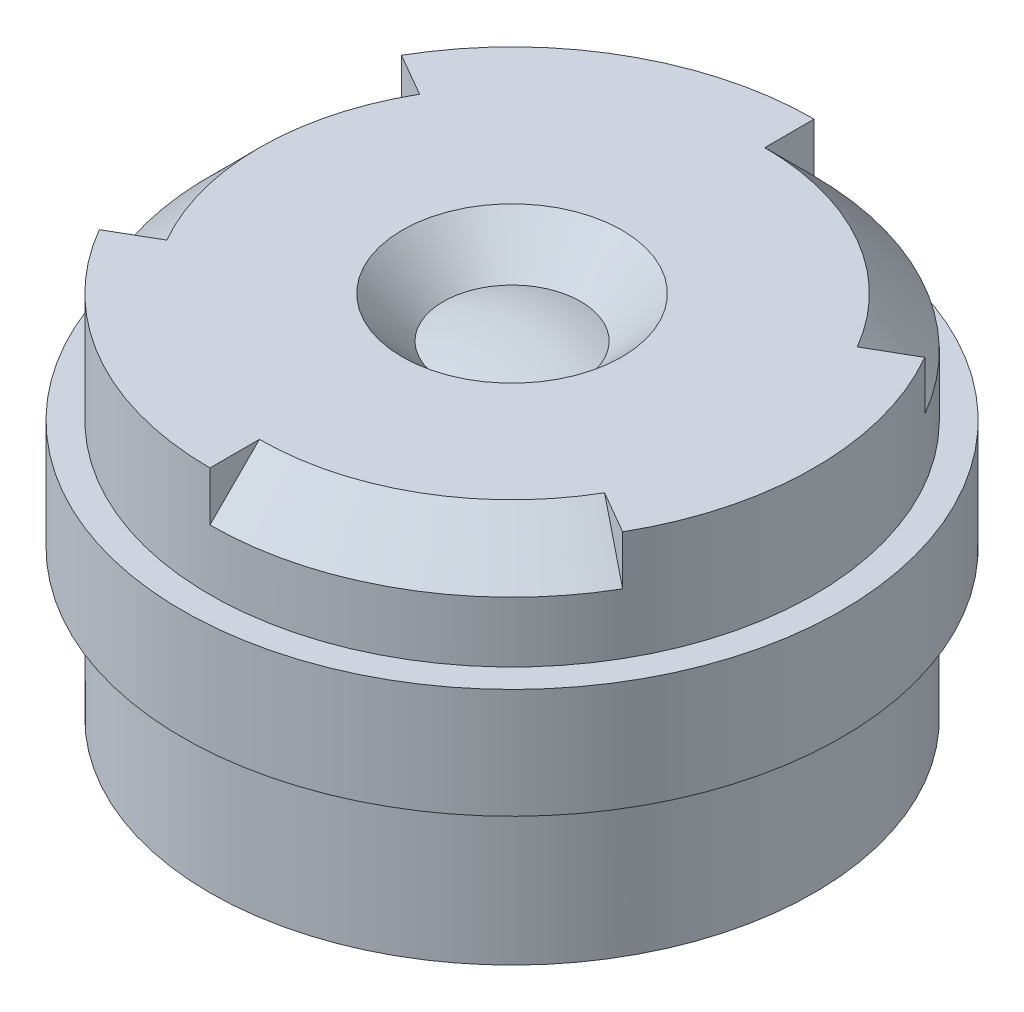
ISO-10303-21;
HEADER;
FILE_DESCRIPTION(('STEP AP214'),'2;1');
FILE_NAME('part.step','',(''),(''),'','','');
FILE_SCHEMA(('AUTOMOTIVE_DESIGN { 1 0 10303 214 1 1 1 1 }'));
ENDSEC;
DATA;
#1=APPLICATION_CONTEXT('core data for automotive mechanical design processes');
#2=APPLICATION_PROTOCOL_DEFINITION('international standard','automotive_design',2000,#1);
#3=PRODUCT_CONTEXT('',#1,'mechanical');
#4=PRODUCT('Part','Part','',(#3));
#5=PRODUCT_RELATED_PRODUCT_CATEGORY('part','',(#4));
#6=PRODUCT_DEFINITION_FORMATION('','',#4);
#7=PRODUCT_DEFINITION_CONTEXT('part definition',#1,'design');
#8=PRODUCT_DEFINITION('design','',#6,#7);
#9=PRODUCT_DEFINITION_SHAPE('','',#8);
#10=(LENGTH_UNIT() NAMED_UNIT(*) SI_UNIT(.MILLI.,.METRE.));
#11=(NAMED_UNIT(*) PLANE_ANGLE_UNIT() SI_UNIT($,.RADIAN.));
#12=(NAMED_UNIT(*) SI_UNIT($,.STERADIAN.) SOLID_ANGLE_UNIT());
#13=UNCERTAINTY_MEASURE_WITH_UNIT(LENGTH_MEASURE(1.E-05),#10,'distance_accuracy_value','');
#14=(GEOMETRIC_REPRESENTATION_CONTEXT(3) GLOBAL_UNCERTAINTY_ASSIGNED_CONTEXT((#13)) GLOBAL_UNIT_ASSIGNED_CONTEXT((#10,
#11,#12)) REPRESENTATION_CONTEXT('',''));
#15=CARTESIAN_POINT('',(0.,0.,0.));
#16=DIRECTION('',(0.,0.,1.));
#17=DIRECTION('',(1.,0.,0.));
#18=AXIS2_PLACEMENT_3D('',#15,#16,#17);
#19=CARTESIAN_POINT('',(1.,0.8,0.));
#20=DIRECTION('',(0.,-1.,0.));
#21=DIRECTION('',(0.,0.,-1.));
#22=AXIS2_PLACEMENT_3D('',#19,#20,#21);
#23=PLANE('',#22);
#24=CARTESIAN_POINT('',(0.,0.8,0.));
#25=DIRECTION('',(0.,1.,0.));
#26=DIRECTION('',(0.,0.,1.));
#27=AXIS2_PLACEMENT_3D('',#24,#25,#26);
#28=CIRCLE('',#27,1.);
#29=CARTESIAN_POINT('',(0.,0.8,1.));
#30=VERTEX_POINT('',#29);
#31=EDGE_CURVE('E11',#30,#30,#28,.T.);
#32=ORIENTED_EDGE('',*,*,#31,.F.);
#33=EDGE_LOOP('',(#32));
#34=FACE_BOUND('',#33,.T.);
#35=DIRECTION('',(0.,0.,-1.));
#36=VECTOR('',#35,1.);
#37=CARTESIAN_POINT('',(0.,0.8,2.3));
#38=LINE('',#37,#36);
#39=CARTESIAN_POINT('',(0.,0.8,2.75));
#40=VERTEX_POINT('',#39);
#41=CARTESIAN_POINT('',(0.,0.8,2.3));
#42=VERTEX_POINT('',#41);
#43=EDGE_CURVE('E120',#40,#42,#38,.T.);
#44=ORIENTED_EDGE('',*,*,#43,.T.);
#45=CARTESIAN_POINT('',(0.,0.8,0.));
#46=DIRECTION('',(0.,1.,0.));
#47=DIRECTION('',(-0.866025403784443,0.,-0.499999999999992));
#48=AXIS2_PLACEMENT_3D('',#45,#46,#47);
#49=CIRCLE('',#48,2.3);
#50=CARTESIAN_POINT('',(1.99185842870422,0.8,1.14999999999998));
#51=VERTEX_POINT('',#50);
#52=EDGE_CURVE('E105',#42,#51,#49,.T.);
#53=ORIENTED_EDGE('',*,*,#52,.T.);
#54=DIRECTION('',(-0.866025403784443,0.,-0.499999999999992));
#55=VECTOR('',#54,1.);
#56=CARTESIAN_POINT('',(1.99185842870422,0.8,1.14999999999998));
#57=LINE('',#56,#55);
#58=CARTESIAN_POINT('',(2.38156986040722,0.8,1.37499999999998));
#59=VERTEX_POINT('',#58);
#60=EDGE_CURVE('E111',#59,#51,#57,.T.);
#61=ORIENTED_EDGE('',*,*,#60,.F.);
#62=CARTESIAN_POINT('',(0.,0.8,0.));
#63=DIRECTION('',(0.,1.,0.));
#64=DIRECTION('',(0.,0.,1.));
#65=AXIS2_PLACEMENT_3D('',#62,#63,#64);
#66=CIRCLE('',#65,2.75);
#67=CARTESIAN_POINT('',(2.38156986040721,0.8,-1.37499999999999));
#68=VERTEX_POINT('',#67);
#69=EDGE_CURVE('E191',#59,#68,#66,.T.);
#70=ORIENTED_EDGE('',*,*,#69,.T.);
#71=DIRECTION('',(-0.86602540378444,0.,0.499999999999998));
#72=VECTOR('',#71,1.);
#73=CARTESIAN_POINT('',(1.99185842870421,0.8,-1.15));
#74=LINE('',#73,#72);
#75=CARTESIAN_POINT('',(1.99185842870421,0.8,-1.15));
#76=VERTEX_POINT('',#75);
#77=EDGE_CURVE('E154',#68,#76,#74,.T.);
#78=ORIENTED_EDGE('',*,*,#77,.T.);
#79=CARTESIAN_POINT('',(0.,0.8,0.));
#80=DIRECTION('',(0.,1.,0.));
#81=DIRECTION('',(0.,0.,1.));
#82=AXIS2_PLACEMENT_3D('',#79,#80,#81);
#83=CIRCLE('',#82,2.3);
#84=CARTESIAN_POINT('',(0.,0.8,-2.3));
#85=VERTEX_POINT('',#84);
#86=EDGE_CURVE('E162',#76,#85,#83,.T.);
#87=ORIENTED_EDGE('',*,*,#86,.T.);
#88=DIRECTION('',(0.,0.,1.));
#89=VECTOR('',#88,1.);
#90=CARTESIAN_POINT('',(0.,0.8,-2.3));
#91=LINE('',#90,#89);
#92=CARTESIAN_POINT('',(0.,0.8,-2.75));
#93=VERTEX_POINT('',#92);
#94=EDGE_CURVE('E147',#93,#85,#91,.T.);
#95=ORIENTED_EDGE('',*,*,#94,.F.);
#96=CARTESIAN_POINT('',(-2.38156986040721,0.8,-1.37499999999999));
#97=VERTEX_POINT('',#96);
#98=EDGE_CURVE('E42',#93,#97,#66,.T.);
#99=ORIENTED_EDGE('',*,*,#98,.T.);
#100=DIRECTION('',(0.86602540378444,0.,0.499999999999998));
#101=VECTOR('',#100,1.);
#102=CARTESIAN_POINT('',(-1.99185842870421,0.8,-1.15));
#103=LINE('',#102,#101);
#104=CARTESIAN_POINT('',(-1.99185842870421,0.8,-1.15));
#105=VERTEX_POINT('',#104);
#106=EDGE_CURVE('E134',#97,#105,#103,.T.);
#107=ORIENTED_EDGE('',*,*,#106,.T.);
#108=CARTESIAN_POINT('',(0.,0.8,0.));
#109=DIRECTION('',(0.,1.,0.));
#110=DIRECTION('',(0.866025403784436,0.,-0.500000000000004));
#111=AXIS2_PLACEMENT_3D('',#108,#109,#110);
#112=CIRCLE('',#111,2.3);
#113=CARTESIAN_POINT('',(-1.9918584287042,0.8,1.15000000000001));
#114=VERTEX_POINT('',#113);
#115=EDGE_CURVE('E142',#105,#114,#112,.T.);
#116=ORIENTED_EDGE('',*,*,#115,.T.);
#117=DIRECTION('',(0.866025403784436,0.,-0.500000000000004));
#118=VECTOR('',#117,1.);
#119=CARTESIAN_POINT('',(-1.9918584287042,0.8,1.15000000000001));
#120=LINE('',#119,#118);
#121=CARTESIAN_POINT('',(-2.3815698604072,0.8,1.37500000000001));
#122=VERTEX_POINT('',#121);
#123=EDGE_CURVE('E123',#122,#114,#120,.T.);
#124=ORIENTED_EDGE('',*,*,#123,.F.);
#125=EDGE_CURVE('E193',#122,#40,#66,.T.);
#126=ORIENTED_EDGE('',*,*,#125,.T.);
#127=EDGE_LOOP('',(#44,#53,#61,#70,#78,#87,#95,#99,#107,#116,#124,#126));
#128=FACE_BOUND('',#127,.T.);
#129=ADVANCED_FACE('F34',(#34,#128),#23,.F.);
#130=CARTESIAN_POINT('',(0.,0.,0.));
#131=DIRECTION('',(0.,1.,0.));
#132=DIRECTION('',(0.,0.,1.));
#133=AXIS2_PLACEMENT_3D('',#130,#131,#132);
#134=CYLINDRICAL_SURFACE('',#133,2.75);
#135=CARTESIAN_POINT('',(0.,-0.2,0.));
#136=DIRECTION('',(0.,-1.,0.));
#137=DIRECTION('',(0.,0.,-1.));
#138=AXIS2_PLACEMENT_3D('',#135,#136,#137);
#139=CIRCLE('',#138,2.75);
#140=CARTESIAN_POINT('',(0.,-0.2,-2.75));
#141=VERTEX_POINT('',#140);
#142=EDGE_CURVE('E168',#141,#141,#139,.T.);
#143=ORIENTED_EDGE('',*,*,#142,.F.);
#144=EDGE_LOOP('',(#143));
#145=FACE_BOUND('',#144,.T.);
#146=DIRECTION('',(0.,1.,0.));
#147=VECTOR('',#146,1.);
#148=CARTESIAN_POINT('',(0.,0.8,2.75));
#149=LINE('',#148,#147);
#150=CARTESIAN_POINT('',(0.,0.349999999999999,2.75));
#151=VERTEX_POINT('',#150);
#152=EDGE_CURVE('E121',#151,#40,#149,.T.);
#153=ORIENTED_EDGE('',*,*,#152,.T.);
#154=ORIENTED_EDGE('',*,*,#125,.F.);
#155=DIRECTION('',(0.,1.,0.));
#156=VECTOR('',#155,1.);
#157=CARTESIAN_POINT('',(-2.3815698604072,0.8,1.37500000000001));
#158=LINE('',#157,#156);
#159=CARTESIAN_POINT('',(-2.3815698604072,0.349999999999999,1.37500000000001));
#160=VERTEX_POINT('',#159);
#161=EDGE_CURVE('E132',#160,#122,#158,.T.);
#162=ORIENTED_EDGE('',*,*,#161,.F.);
#163=CARTESIAN_POINT('',(0.,0.349999999999999,0.));
#164=DIRECTION('',(0.,1.,0.));
#165=DIRECTION('',(0.866025403784436,0.,-0.500000000000004));
#166=AXIS2_PLACEMENT_3D('',#163,#164,#165);
#167=CIRCLE('',#166,2.75);
#168=CARTESIAN_POINT('',(-2.38156986040721,0.349999999999999,-1.37499999999999));
#169=VERTEX_POINT('',#168);
#170=EDGE_CURVE('E145',#169,#160,#167,.T.);
#171=ORIENTED_EDGE('',*,*,#170,.F.);
#172=DIRECTION('',(0.,1.,0.));
#173=VECTOR('',#172,1.);
#174=CARTESIAN_POINT('',(-2.38156986040721,0.8,-1.37499999999999));
#175=LINE('',#174,#173);
#176=EDGE_CURVE('E139',#169,#97,#175,.T.);
#177=ORIENTED_EDGE('',*,*,#176,.T.);
#178=ORIENTED_EDGE('',*,*,#98,.F.);
#179=DIRECTION('',(0.,1.,0.));
#180=VECTOR('',#179,1.);
#181=CARTESIAN_POINT('',(0.,0.8,-2.75));
#182=LINE('',#181,#180);
#183=CARTESIAN_POINT('',(0.,0.349999999999999,-2.75));
#184=VERTEX_POINT('',#183);
#185=EDGE_CURVE('E152',#184,#93,#182,.T.);
#186=ORIENTED_EDGE('',*,*,#185,.F.);
#187=CARTESIAN_POINT('',(0.,0.349999999999999,0.));
#188=DIRECTION('',(0.,1.,0.));
#189=DIRECTION('',(0.,0.,1.));
#190=AXIS2_PLACEMENT_3D('',#187,#188,#189);
#191=CIRCLE('',#190,2.75);
#192=CARTESIAN_POINT('',(2.38156986040721,0.349999999999999,-1.37499999999999));
#193=VERTEX_POINT('',#192);
#194=EDGE_CURVE('E165',#193,#184,#191,.T.);
#195=ORIENTED_EDGE('',*,*,#194,.F.);
#196=DIRECTION('',(0.,1.,0.));
#197=VECTOR('',#196,1.);
#198=CARTESIAN_POINT('',(2.38156986040721,0.8,-1.37499999999999));
#199=LINE('',#198,#197);
#200=EDGE_CURVE('E159',#193,#68,#199,.T.);
#201=ORIENTED_EDGE('',*,*,#200,.T.);
#202=ORIENTED_EDGE('',*,*,#69,.F.);
#203=DIRECTION('',(0.,1.,0.));
#204=VECTOR('',#203,1.);
#205=CARTESIAN_POINT('',(2.38156986040722,0.8,1.37499999999998));
#206=LINE('',#205,#204);
#207=CARTESIAN_POINT('',(2.38156986040722,0.349999999999999,1.37499999999998));
#208=VERTEX_POINT('',#207);
#209=EDGE_CURVE('E110',#208,#59,#206,.T.);
#210=ORIENTED_EDGE('',*,*,#209,.F.);
#211=CARTESIAN_POINT('',(0.,0.349999999999999,0.));
#212=DIRECTION('',(0.,1.,0.));
#213=DIRECTION('',(-0.866025403784443,0.,-0.499999999999992));
#214=AXIS2_PLACEMENT_3D('',#211,#212,#213);
#215=CIRCLE('',#214,2.75);
#216=EDGE_CURVE('E108',#151,#208,#215,.T.);
#217=ORIENTED_EDGE('',*,*,#216,.F.);
#218=EDGE_LOOP('',(#153,#154,#162,#171,#177,#178,#186,#195,#201,#202,#210,#217));
#219=FACE_BOUND('',#218,.T.);
#220=ADVANCED_FACE('F203',(#145,#219),#134,.T.);
#221=CARTESIAN_POINT('',(0.,-1.2,0.));
#222=DIRECTION('',(0.,-1.,0.));
#223=DIRECTION('',(0.,0.,-1.));
#224=AXIS2_PLACEMENT_3D('',#221,#222,#223);
#225=CIRCLE('',#224,2.75);
#226=CARTESIAN_POINT('',(0.,-1.2,-2.75));
#227=VERTEX_POINT('',#226);
#228=EDGE_CURVE('E177',#227,#227,#225,.T.);
#229=ORIENTED_EDGE('',*,*,#228,.T.);
#230=EDGE_LOOP('',(#229));
#231=FACE_BOUND('',#230,.T.);
#232=CARTESIAN_POINT('',(0.,-2.55,0.));
#233=DIRECTION('',(0.,1.,0.));
#234=DIRECTION('',(0.,0.,1.));
#235=AXIS2_PLACEMENT_3D('',#232,#233,#234);
#236=CIRCLE('',#235,2.75);
#237=CARTESIAN_POINT('',(0.,-2.55,2.75));
#238=VERTEX_POINT('',#237);
#239=EDGE_CURVE('E189',#238,#238,#236,.T.);
#240=ORIENTED_EDGE('',*,*,#239,.T.);
#241=EDGE_LOOP('',(#240));
#242=FACE_BOUND('',#241,.T.);
#243=ADVANCED_FACE('F237',(#231,#242),#134,.T.);
#244=CARTESIAN_POINT('',(2.75,-2.55,0.));
#245=DIRECTION('',(0.,1.,0.));
#246=DIRECTION('',(0.,0.,1.));
#247=AXIS2_PLACEMENT_3D('',#244,#245,#246);
#248=PLANE('',#247);
#249=ORIENTED_EDGE('',*,*,#239,.F.);
#250=EDGE_LOOP('',(#249));
#251=FACE_BOUND('',#250,.T.);
#252=CARTESIAN_POINT('',(0.,-2.55,0.));
#253=DIRECTION('',(0.,1.,0.));
#254=DIRECTION('',(0.,0.,1.));
#255=AXIS2_PLACEMENT_3D('',#252,#253,#254);
#256=CIRCLE('',#255,2.1);
#257=CARTESIAN_POINT('',(0.,-2.55,2.1));
#258=VERTEX_POINT('',#257);
#259=EDGE_CURVE('E186',#258,#258,#256,.T.);
#260=ORIENTED_EDGE('',*,*,#259,.T.);
#261=EDGE_LOOP('',(#260));
#262=FACE_BOUND('',#261,.T.);
#263=ADVANCED_FACE('F242',(#251,#262),#248,.F.);
#264=CARTESIAN_POINT('',(0.,-2.25,0.));
#265=DIRECTION('',(0.,-1.,0.));
#266=DIRECTION('',(0.,0.,-1.));
#267=AXIS2_PLACEMENT_3D('',#264,#265,#266);
#268=CONICAL_SURFACE('',#267,1.8,0.78539816339745);
#269=ORIENTED_EDGE('',*,*,#259,.F.);
#270=EDGE_LOOP('',(#269));
#271=FACE_BOUND('',#270,.T.);
#272=CARTESIAN_POINT('',(0.,-2.25,0.));
#273=DIRECTION('',(0.,1.,0.));
#274=DIRECTION('',(0.,0.,1.));
#275=AXIS2_PLACEMENT_3D('',#272,#273,#274);
#276=CIRCLE('',#275,1.8);
#277=CARTESIAN_POINT('',(0.,-2.25,1.8));
#278=VERTEX_POINT('',#277);
#279=EDGE_CURVE('E183',#278,#278,#276,.T.);
#280=ORIENTED_EDGE('',*,*,#279,.T.);
#281=EDGE_LOOP('',(#280));
#282=FACE_BOUND('',#281,.T.);
#283=ADVANCED_FACE('F245',(#271,#282),#268,.F.);
#284=CARTESIAN_POINT('',(0.,3.,0.));
#285=DIRECTION('',(0.,1.,0.));
#286=DIRECTION('',(1.,0.,0.));
#287=AXIS2_PLACEMENT_3D('',#284,#285,#286);
#288=SPHERICAL_SURFACE('',#287,5.55);
#289=ORIENTED_EDGE('',*,*,#279,.F.);
#290=EDGE_LOOP('',(#289));
#291=FACE_BOUND('',#290,.T.);
#292=ADVANCED_FACE('F249',(#291),#288,.T.);
#293=CARTESIAN_POINT('',(2.75,-1.2,0.));
#294=DIRECTION('',(0.,-1.,0.));
#295=DIRECTION('',(0.,0.,-1.));
#296=AXIS2_PLACEMENT_3D('',#293,#294,#295);
#297=PLANE('',#296);
#298=CARTESIAN_POINT('',(0.,-1.2,0.));
#299=DIRECTION('',(0.,-1.,0.));
#300=DIRECTION('',(0.,0.,-1.));
#301=AXIS2_PLACEMENT_3D('',#298,#299,#300);
#302=CIRCLE('',#301,3.);
#303=CARTESIAN_POINT('',(0.,-1.2,-3.));
#304=VERTEX_POINT('',#303);
#305=EDGE_CURVE('E174',#304,#304,#302,.T.);
#306=ORIENTED_EDGE('',*,*,#305,.T.);
#307=EDGE_LOOP('',(#306));
#308=FACE_BOUND('',#307,.T.);
#309=ORIENTED_EDGE('',*,*,#228,.F.);
#310=EDGE_LOOP('',(#309));
#311=FACE_BOUND('',#310,.T.);
#312=ADVANCED_FACE('F253',(#308,#311),#297,.T.);
#313=CARTESIAN_POINT('',(0.,0.,0.));
#314=DIRECTION('',(0.,-1.,0.));
#315=DIRECTION('',(0.,0.,-1.));
#316=AXIS2_PLACEMENT_3D('',#313,#314,#315);
#317=CYLINDRICAL_SURFACE('',#316,3.);
#318=CARTESIAN_POINT('',(0.,-0.2,0.));
#319=DIRECTION('',(0.,-1.,0.));
#320=DIRECTION('',(0.,0.,-1.));
#321=AXIS2_PLACEMENT_3D('',#318,#319,#320);
#322=CIRCLE('',#321,3.);
#323=CARTESIAN_POINT('',(0.,-0.2,-3.));
#324=VERTEX_POINT('',#323);
#325=EDGE_CURVE('E171',#324,#324,#322,.T.);
#326=ORIENTED_EDGE('',*,*,#325,.T.);
#327=EDGE_LOOP('',(#326));
#328=FACE_BOUND('',#327,.T.);
#329=ORIENTED_EDGE('',*,*,#305,.F.);
#330=EDGE_LOOP('',(#329));
#331=FACE_BOUND('',#330,.T.);
#332=ADVANCED_FACE('F262',(#328,#331),#317,.T.);
#333=CARTESIAN_POINT('',(2.75,-0.2,0.));
#334=DIRECTION('',(0.,1.,0.));
#335=DIRECTION('',(0.,0.,1.));
#336=AXIS2_PLACEMENT_3D('',#333,#334,#335);
#337=PLANE('',#336);
#338=ORIENTED_EDGE('',*,*,#142,.T.);
#339=EDGE_LOOP('',(#338));
#340=FACE_BOUND('',#339,.T.);
#341=ORIENTED_EDGE('',*,*,#325,.F.);
#342=EDGE_LOOP('',(#341));
#343=FACE_BOUND('',#342,.T.);
#344=ADVANCED_FACE('F258',(#340,#343),#337,.T.);
#345=CARTESIAN_POINT('',(0.,-1.478125,0.));
#346=DIRECTION('',(0.,1.,0.));
#347=DIRECTION('',(1.,0.,0.));
#348=AXIS2_PLACEMENT_3D('',#345,#346,#347);
#349=SPHERICAL_SURFACE('',#348,2.003125);
#350=CARTESIAN_POINT('',(0.,0.425,0.));
#351=DIRECTION('',(0.,1.,0.));
#352=DIRECTION('',(0.,0.,1.));
#353=AXIS2_PLACEMENT_3D('',#350,#351,#352);
#354=CIRCLE('',#353,0.625);
#355=CARTESIAN_POINT('',(0.,0.425,0.625));
#356=VERTEX_POINT('',#355);
#357=EDGE_CURVE('E180',#356,#356,#354,.T.);
#358=ORIENTED_EDGE('',*,*,#357,.T.);
#359=EDGE_LOOP('',(#358));
#360=FACE_BOUND('',#359,.T.);
#361=ADVANCED_FACE('F255',(#360),#349,.T.);
#362=CARTESIAN_POINT('',(0.,0.8,0.));
#363=DIRECTION('',(0.,1.,0.));
#364=DIRECTION('',(0.,0.,1.));
#365=AXIS2_PLACEMENT_3D('',#362,#363,#364);
#366=CONICAL_SURFACE('',#365,1.,0.785398163397449);
#367=ORIENTED_EDGE('',*,*,#357,.F.);
#368=EDGE_LOOP('',(#367));
#369=FACE_BOUND('',#368,.T.);
#370=ORIENTED_EDGE('',*,*,#31,.T.);
#371=EDGE_LOOP('',(#370));
#372=FACE_BOUND('',#371,.T.);
#373=ADVANCED_FACE('F36',(#369,#372),#366,.F.);
#374=CARTESIAN_POINT('',(0.,0.8,0.));
#375=DIRECTION('',(0.,-1.,0.));
#376=DIRECTION('',(0.,0.,-1.));
#377=AXIS2_PLACEMENT_3D('',#374,#375,#376);
#378=CONICAL_SURFACE('',#377,2.3,0.785398163397448);
#379=DIRECTION('',(0.612372435695795,-0.707106781186547,-0.353553390593272));
#380=VECTOR('',#379,1.);
#381=CARTESIAN_POINT('',(2.38156986040721,0.349999999999999,-1.37499999999999));
#382=LINE('',#381,#380);
#383=EDGE_CURVE('E157',#76,#193,#382,.T.);
#384=ORIENTED_EDGE('',*,*,#383,.T.);
#385=ORIENTED_EDGE('',*,*,#194,.T.);
#386=DIRECTION('',(0.,-0.707106781186547,-0.707106781186547));
#387=VECTOR('',#386,1.);
#388=CARTESIAN_POINT('',(0.,0.349999999999999,-2.75));
#389=LINE('',#388,#387);
#390=EDGE_CURVE('E150',#85,#184,#389,.T.);
#391=ORIENTED_EDGE('',*,*,#390,.F.);
#392=ORIENTED_EDGE('',*,*,#86,.F.);
#393=EDGE_LOOP('',(#384,#385,#391,#392));
#394=FACE_BOUND('',#393,.T.);
#395=ADVANCED_FACE('F206',(#394),#378,.T.);
#396=CARTESIAN_POINT('',(0.,0.,0.));
#397=DIRECTION('',(-0.499999999999998,0.,-0.86602540378444));
#398=DIRECTION('',(-0.86602540378444,0.,0.499999999999998));
#399=AXIS2_PLACEMENT_3D('',#396,#397,#398);
#400=PLANE('',#399);
#401=ORIENTED_EDGE('',*,*,#77,.F.);
#402=ORIENTED_EDGE('',*,*,#200,.F.);
#403=ORIENTED_EDGE('',*,*,#383,.F.);
#404=EDGE_LOOP('',(#401,#402,#403));
#405=FACE_BOUND('',#404,.T.);
#406=ADVANCED_FACE('F201',(#405),#400,.T.);
#407=CARTESIAN_POINT('',(0.,0.,0.));
#408=DIRECTION('',(-1.,0.,0.));
#409=DIRECTION('',(0.,0.,1.));
#410=AXIS2_PLACEMENT_3D('',#407,#408,#409);
#411=PLANE('',#410);
#412=ORIENTED_EDGE('',*,*,#94,.T.);
#413=ORIENTED_EDGE('',*,*,#390,.T.);
#414=ORIENTED_EDGE('',*,*,#185,.T.);
#415=EDGE_LOOP('',(#412,#413,#414));
#416=FACE_BOUND('',#415,.T.);
#417=ADVANCED_FACE('F274',(#416),#411,.F.);
#418=CARTESIAN_POINT('',(0.,0.8,0.));
#419=DIRECTION('',(0.,-1.,0.));
#420=DIRECTION('',(-0.866025403784436,0.,0.500000000000004));
#421=AXIS2_PLACEMENT_3D('',#418,#419,#420);
#422=CONICAL_SURFACE('',#421,2.3,0.785398163397448);
#423=DIRECTION('',(-0.612372435695795,-0.707106781186547,-0.353553390593272));
#424=VECTOR('',#423,1.);
#425=CARTESIAN_POINT('',(-2.38156986040721,0.349999999999999,-1.37499999999999));
#426=LINE('',#425,#424);
#427=EDGE_CURVE('E137',#105,#169,#426,.T.);
#428=ORIENTED_EDGE('',*,*,#427,.T.);
#429=ORIENTED_EDGE('',*,*,#170,.T.);
#430=DIRECTION('',(-0.612372435695793,-0.707106781186547,0.353553390593277));
#431=VECTOR('',#430,1.);
#432=CARTESIAN_POINT('',(-2.3815698604072,0.349999999999999,1.37500000000001));
#433=LINE('',#432,#431);
#434=EDGE_CURVE('E57',#114,#160,#433,.T.);
#435=ORIENTED_EDGE('',*,*,#434,.F.);
#436=ORIENTED_EDGE('',*,*,#115,.F.);
#437=EDGE_LOOP('',(#428,#429,#435,#436));
#438=FACE_BOUND('',#437,.T.);
#439=ADVANCED_FACE('F217',(#438),#422,.T.);
#440=CARTESIAN_POINT('',(0.,0.,0.));
#441=DIRECTION('',(-0.499999999999998,0.,0.86602540378444));
#442=DIRECTION('',(0.86602540378444,0.,0.499999999999998));
#443=AXIS2_PLACEMENT_3D('',#440,#441,#442);
#444=PLANE('',#443);
#445=ORIENTED_EDGE('',*,*,#106,.F.);
#446=ORIENTED_EDGE('',*,*,#176,.F.);
#447=ORIENTED_EDGE('',*,*,#427,.F.);
#448=EDGE_LOOP('',(#445,#446,#447));
#449=FACE_BOUND('',#448,.T.);
#450=ADVANCED_FACE('F213',(#449),#444,.T.);
#451=CARTESIAN_POINT('',(0.,0.,0.));
#452=DIRECTION('',(0.500000000000004,0.,0.866025403784436));
#453=DIRECTION('',(0.866025403784436,0.,-0.500000000000004));
#454=AXIS2_PLACEMENT_3D('',#451,#452,#453);
#455=PLANE('',#454);
#456=ORIENTED_EDGE('',*,*,#123,.T.);
#457=ORIENTED_EDGE('',*,*,#434,.T.);
#458=ORIENTED_EDGE('',*,*,#161,.T.);
#459=EDGE_LOOP('',(#456,#457,#458));
#460=FACE_BOUND('',#459,.T.);
#461=ADVANCED_FACE('F218',(#460),#455,.F.);
#462=CARTESIAN_POINT('',(0.,0.8,0.));
#463=DIRECTION('',(0.,-1.,0.));
#464=DIRECTION('',(0.866025403784443,0.,0.499999999999992));
#465=AXIS2_PLACEMENT_3D('',#462,#463,#464);
#466=CONICAL_SURFACE('',#465,2.3,0.785398163397448);
#467=DIRECTION('',(0.,-0.707106781186547,0.707106781186547));
#468=VECTOR('',#467,1.);
#469=CARTESIAN_POINT('',(0.,0.349999999999999,2.75));
#470=LINE('',#469,#468);
#471=EDGE_CURVE('E126',#42,#151,#470,.T.);
#472=ORIENTED_EDGE('',*,*,#471,.T.);
#473=ORIENTED_EDGE('',*,*,#216,.T.);
#474=DIRECTION('',(0.612372435695798,-0.707106781186547,0.353553390593268));
#475=VECTOR('',#474,1.);
#476=CARTESIAN_POINT('',(2.38156986040722,0.349999999999999,1.37499999999998));
#477=LINE('',#476,#475);
#478=EDGE_CURVE('E49',#51,#208,#477,.T.);
#479=ORIENTED_EDGE('',*,*,#478,.F.);
#480=ORIENTED_EDGE('',*,*,#52,.F.);
#481=EDGE_LOOP('',(#472,#473,#479,#480));
#482=FACE_BOUND('',#481,.T.);
#483=ADVANCED_FACE('F103',(#482),#466,.T.);
#484=CARTESIAN_POINT('',(0.,0.,0.));
#485=DIRECTION('',(1.,0.,0.));
#486=DIRECTION('',(0.,0.,-1.));
#487=AXIS2_PLACEMENT_3D('',#484,#485,#486);
#488=PLANE('',#487);
#489=ORIENTED_EDGE('',*,*,#43,.F.);
#490=ORIENTED_EDGE('',*,*,#152,.F.);
#491=ORIENTED_EDGE('',*,*,#471,.F.);
#492=EDGE_LOOP('',(#489,#490,#491));
#493=FACE_BOUND('',#492,.T.);
#494=ADVANCED_FACE('F221',(#493),#488,.T.);
#495=CARTESIAN_POINT('',(0.,0.,0.));
#496=DIRECTION('',(0.499999999999992,0.,-0.866025403784443));
#497=DIRECTION('',(-0.866025403784443,0.,-0.499999999999992));
#498=AXIS2_PLACEMENT_3D('',#495,#496,#497);
#499=PLANE('',#498);
#500=ORIENTED_EDGE('',*,*,#60,.T.);
#501=ORIENTED_EDGE('',*,*,#478,.T.);
#502=ORIENTED_EDGE('',*,*,#209,.T.);
#503=EDGE_LOOP('',(#500,#501,#502));
#504=FACE_BOUND('',#503,.T.);
#505=ADVANCED_FACE('F114',(#504),#499,.F.);
#506=CLOSED_SHELL('',(#129,#220,#243,#263,#283,#292,#312,#332,#344,#361,#373,#395,#406,#417,
#439,#450,#461,#483,#494,#505));
#507=MANIFOLD_SOLID_BREP('B2',#506);
#508=ADVANCED_BREP_SHAPE_REPRESENTATION('',(#18,#507),#14);
#509=SHAPE_DEFINITION_REPRESENTATION(#9,#508);
ENDSEC;
END-ISO-10303-21;
